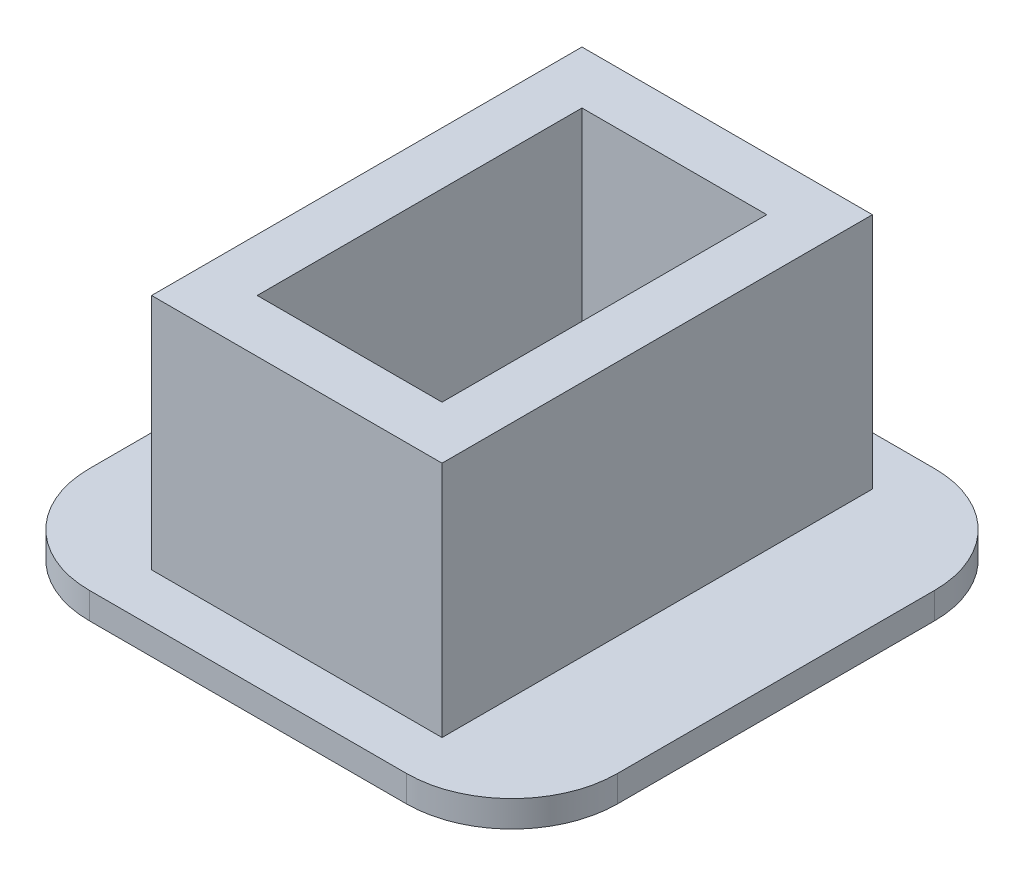
ISO-10303-21;
HEADER;
FILE_DESCRIPTION(('STEP AP214'),'2;1');
FILE_NAME('part.step','',(''),(''),'','','');
FILE_SCHEMA(('AUTOMOTIVE_DESIGN { 1 0 10303 214 1 1 1 1 }'));
ENDSEC;
DATA;
#1=APPLICATION_CONTEXT('core data for automotive mechanical design processes');
#2=APPLICATION_PROTOCOL_DEFINITION('international standard','automotive_design',2000,#1);
#3=PRODUCT_CONTEXT('',#1,'mechanical');
#4=PRODUCT('Part','Part','',(#3));
#5=PRODUCT_RELATED_PRODUCT_CATEGORY('part','',(#4));
#6=PRODUCT_DEFINITION_FORMATION('','',#4);
#7=PRODUCT_DEFINITION_CONTEXT('part definition',#1,'design');
#8=PRODUCT_DEFINITION('design','',#6,#7);
#9=PRODUCT_DEFINITION_SHAPE('','',#8);
#10=(LENGTH_UNIT() NAMED_UNIT(*) SI_UNIT(.MILLI.,.METRE.));
#11=(NAMED_UNIT(*) PLANE_ANGLE_UNIT() SI_UNIT($,.RADIAN.));
#12=(NAMED_UNIT(*) SI_UNIT($,.STERADIAN.) SOLID_ANGLE_UNIT());
#13=UNCERTAINTY_MEASURE_WITH_UNIT(LENGTH_MEASURE(1.E-05),#10,'distance_accuracy_value','');
#14=(GEOMETRIC_REPRESENTATION_CONTEXT(3) GLOBAL_UNCERTAINTY_ASSIGNED_CONTEXT((#13)) GLOBAL_UNIT_ASSIGNED_CONTEXT((#10,
#11,#12)) REPRESENTATION_CONTEXT('',''));
#15=CARTESIAN_POINT('',(0.,0.,0.));
#16=DIRECTION('',(0.,0.,1.));
#17=DIRECTION('',(1.,0.,0.));
#18=AXIS2_PLACEMENT_3D('',#15,#16,#17);
#19=CARTESIAN_POINT('',(0.,18.,0.));
#20=DIRECTION('',(0.,-1.,0.));
#21=DIRECTION('',(0.,0.,-1.));
#22=AXIS2_PLACEMENT_3D('',#19,#20,#21);
#23=PLANE('',#22);
#24=DIRECTION('',(0.,0.,-1.));
#25=VECTOR('',#24,1.);
#26=CARTESIAN_POINT('',(11.,18.,-16.3));
#27=LINE('',#26,#25);
#28=CARTESIAN_POINT('',(11.,18.,16.3));
#29=VERTEX_POINT('',#28);
#30=CARTESIAN_POINT('',(11.,18.,-16.3));
#31=VERTEX_POINT('',#30);
#32=EDGE_CURVE('E184',#29,#31,#27,.T.);
#33=ORIENTED_EDGE('',*,*,#32,.T.);
#34=DIRECTION('',(-1.,0.,0.));
#35=VECTOR('',#34,1.);
#36=CARTESIAN_POINT('',(11.,18.,-16.3));
#37=LINE('',#36,#35);
#38=CARTESIAN_POINT('',(-11.,18.,-16.3));
#39=VERTEX_POINT('',#38);
#40=EDGE_CURVE('E187',#31,#39,#37,.T.);
#41=ORIENTED_EDGE('',*,*,#40,.T.);
#42=DIRECTION('',(0.,0.,1.));
#43=VECTOR('',#42,1.);
#44=CARTESIAN_POINT('',(-11.,18.,-16.3));
#45=LINE('',#44,#43);
#46=CARTESIAN_POINT('',(-11.,18.,16.3));
#47=VERTEX_POINT('',#46);
#48=EDGE_CURVE('E190',#39,#47,#45,.T.);
#49=ORIENTED_EDGE('',*,*,#48,.T.);
#50=DIRECTION('',(1.,0.,0.));
#51=VECTOR('',#50,1.);
#52=CARTESIAN_POINT('',(11.,18.,16.3));
#53=LINE('',#52,#51);
#54=EDGE_CURVE('E192',#47,#29,#53,.T.);
#55=ORIENTED_EDGE('',*,*,#54,.T.);
#56=EDGE_LOOP('',(#33,#41,#49,#55));
#57=FACE_BOUND('',#56,.T.);
#58=DIRECTION('',(0.,0.,-1.));
#59=VECTOR('',#58,1.);
#60=CARTESIAN_POINT('',(7.,18.,-12.3));
#61=LINE('',#60,#59);
#62=CARTESIAN_POINT('',(7.00000000000001,18.,12.3));
#63=VERTEX_POINT('',#62);
#64=CARTESIAN_POINT('',(7.,18.,-12.3));
#65=VERTEX_POINT('',#64);
#66=EDGE_CURVE('E172',#63,#65,#61,.T.);
#67=ORIENTED_EDGE('',*,*,#66,.F.);
#68=DIRECTION('',(1.,0.,0.));
#69=VECTOR('',#68,1.);
#70=CARTESIAN_POINT('',(7.00000000000001,18.,12.3));
#71=LINE('',#70,#69);
#72=CARTESIAN_POINT('',(-7.,18.,12.3));
#73=VERTEX_POINT('',#72);
#74=EDGE_CURVE('E153',#73,#63,#71,.T.);
#75=ORIENTED_EDGE('',*,*,#74,.F.);
#76=DIRECTION('',(0.,0.,1.));
#77=VECTOR('',#76,1.);
#78=CARTESIAN_POINT('',(-7.,18.,-12.3));
#79=LINE('',#78,#77);
#80=CARTESIAN_POINT('',(-7.,18.,-12.3));
#81=VERTEX_POINT('',#80);
#82=EDGE_CURVE('E285',#81,#73,#79,.T.);
#83=ORIENTED_EDGE('',*,*,#82,.F.);
#84=DIRECTION('',(-1.,0.,0.));
#85=VECTOR('',#84,1.);
#86=CARTESIAN_POINT('',(7.,18.,-12.3));
#87=LINE('',#86,#85);
#88=EDGE_CURVE('E174',#65,#81,#87,.T.);
#89=ORIENTED_EDGE('',*,*,#88,.F.);
#90=EDGE_LOOP('',(#67,#75,#83,#89));
#91=FACE_BOUND('',#90,.T.);
#92=ADVANCED_FACE('F32',(#57,#91),#23,.F.);
#93=CARTESIAN_POINT('',(11.,18.,-16.3));
#94=DIRECTION('',(-1.,0.,0.));
#95=DIRECTION('',(0.,0.,1.));
#96=AXIS2_PLACEMENT_3D('',#93,#94,#95);
#97=PLANE('',#96);
#98=DIRECTION('',(0.,0.,-1.));
#99=VECTOR('',#98,1.);
#100=CARTESIAN_POINT('',(11.,0.,-16.3));
#101=LINE('',#100,#99);
#102=CARTESIAN_POINT('',(11.,0.,16.3));
#103=VERTEX_POINT('',#102);
#104=CARTESIAN_POINT('',(11.,0.,-16.3));
#105=VERTEX_POINT('',#104);
#106=EDGE_CURVE('E183',#103,#105,#101,.T.);
#107=ORIENTED_EDGE('',*,*,#106,.T.);
#108=DIRECTION('',(0.,-1.,0.));
#109=VECTOR('',#108,1.);
#110=CARTESIAN_POINT('',(11.,18.,-16.3));
#111=LINE('',#110,#109);
#112=EDGE_CURVE('E213',#31,#105,#111,.T.);
#113=ORIENTED_EDGE('',*,*,#112,.F.);
#114=ORIENTED_EDGE('',*,*,#32,.F.);
#115=DIRECTION('',(0.,-1.,0.));
#116=VECTOR('',#115,1.);
#117=CARTESIAN_POINT('',(11.,18.,16.3));
#118=LINE('',#117,#116);
#119=EDGE_CURVE('E194',#29,#103,#118,.T.);
#120=ORIENTED_EDGE('',*,*,#119,.T.);
#121=EDGE_LOOP('',(#107,#113,#114,#120));
#122=FACE_BOUND('',#121,.T.);
#123=ADVANCED_FACE('F297',(#122),#97,.F.);
#124=CARTESIAN_POINT('',(11.,18.,-16.3));
#125=DIRECTION('',(0.,0.,1.));
#126=DIRECTION('',(1.,0.,0.));
#127=AXIS2_PLACEMENT_3D('',#124,#125,#126);
#128=PLANE('',#127);
#129=DIRECTION('',(-1.,0.,0.));
#130=VECTOR('',#129,1.);
#131=CARTESIAN_POINT('',(11.,0.,-16.3));
#132=LINE('',#131,#130);
#133=CARTESIAN_POINT('',(-11.,0.,-16.3));
#134=VERTEX_POINT('',#133);
#135=EDGE_CURVE('E197',#105,#134,#132,.T.);
#136=ORIENTED_EDGE('',*,*,#135,.T.);
#137=DIRECTION('',(0.,-1.,0.));
#138=VECTOR('',#137,1.);
#139=CARTESIAN_POINT('',(-11.,18.,-16.3));
#140=LINE('',#139,#138);
#141=EDGE_CURVE('E210',#39,#134,#140,.T.);
#142=ORIENTED_EDGE('',*,*,#141,.F.);
#143=ORIENTED_EDGE('',*,*,#40,.F.);
#144=ORIENTED_EDGE('',*,*,#112,.T.);
#145=EDGE_LOOP('',(#136,#142,#143,#144));
#146=FACE_BOUND('',#145,.T.);
#147=ADVANCED_FACE('F303',(#146),#128,.F.);
#148=CARTESIAN_POINT('',(-11.,18.,-16.3));
#149=DIRECTION('',(1.,0.,0.));
#150=DIRECTION('',(0.,0.,-1.));
#151=AXIS2_PLACEMENT_3D('',#148,#149,#150);
#152=PLANE('',#151);
#153=DIRECTION('',(0.,0.,1.));
#154=VECTOR('',#153,1.);
#155=CARTESIAN_POINT('',(-11.,0.,-16.3));
#156=LINE('',#155,#154);
#157=CARTESIAN_POINT('',(-11.,0.,16.3));
#158=VERTEX_POINT('',#157);
#159=EDGE_CURVE('E200',#134,#158,#156,.T.);
#160=ORIENTED_EDGE('',*,*,#159,.T.);
#161=DIRECTION('',(0.,-1.,0.));
#162=VECTOR('',#161,1.);
#163=CARTESIAN_POINT('',(-11.,18.,16.3));
#164=LINE('',#163,#162);
#165=EDGE_CURVE('E207',#47,#158,#164,.T.);
#166=ORIENTED_EDGE('',*,*,#165,.F.);
#167=ORIENTED_EDGE('',*,*,#48,.F.);
#168=ORIENTED_EDGE('',*,*,#141,.T.);
#169=EDGE_LOOP('',(#160,#166,#167,#168));
#170=FACE_BOUND('',#169,.T.);
#171=ADVANCED_FACE('F312',(#170),#152,.F.);
#172=CARTESIAN_POINT('',(11.,18.,16.3));
#173=DIRECTION('',(0.,0.,-1.));
#174=DIRECTION('',(-1.,0.,0.));
#175=AXIS2_PLACEMENT_3D('',#172,#173,#174);
#176=PLANE('',#175);
#177=DIRECTION('',(1.,0.,0.));
#178=VECTOR('',#177,1.);
#179=CARTESIAN_POINT('',(11.,0.,16.3));
#180=LINE('',#179,#178);
#181=EDGE_CURVE('E188',#158,#103,#180,.T.);
#182=ORIENTED_EDGE('',*,*,#181,.T.);
#183=ORIENTED_EDGE('',*,*,#119,.F.);
#184=ORIENTED_EDGE('',*,*,#54,.F.);
#185=ORIENTED_EDGE('',*,*,#165,.T.);
#186=EDGE_LOOP('',(#182,#183,#184,#185));
#187=FACE_BOUND('',#186,.T.);
#188=ADVANCED_FACE('F309',(#187),#176,.F.);
#189=CARTESIAN_POINT('',(7.,18.,-12.3));
#190=DIRECTION('',(-1.,0.,0.));
#191=DIRECTION('',(0.,0.,1.));
#192=AXIS2_PLACEMENT_3D('',#189,#190,#191);
#193=PLANE('',#192);
#194=DIRECTION('',(0.,0.,-1.));
#195=VECTOR('',#194,1.);
#196=CARTESIAN_POINT('',(7.,0.,-12.3));
#197=LINE('',#196,#195);
#198=CARTESIAN_POINT('',(7.00000000000001,0.,12.3));
#199=VERTEX_POINT('',#198);
#200=CARTESIAN_POINT('',(7.,0.,-12.3));
#201=VERTEX_POINT('',#200);
#202=EDGE_CURVE('E160',#199,#201,#197,.T.);
#203=ORIENTED_EDGE('',*,*,#202,.F.);
#204=DIRECTION('',(0.,-1.,0.));
#205=VECTOR('',#204,1.);
#206=CARTESIAN_POINT('',(7.00000000000001,18.,12.3));
#207=LINE('',#206,#205);
#208=EDGE_CURVE('E146',#63,#199,#207,.T.);
#209=ORIENTED_EDGE('',*,*,#208,.F.);
#210=ORIENTED_EDGE('',*,*,#66,.T.);
#211=DIRECTION('',(0.,-1.,0.));
#212=VECTOR('',#211,1.);
#213=CARTESIAN_POINT('',(7.,18.,-12.3));
#214=LINE('',#213,#212);
#215=EDGE_CURVE('E163',#65,#201,#214,.T.);
#216=ORIENTED_EDGE('',*,*,#215,.T.);
#217=EDGE_LOOP('',(#203,#209,#210,#216));
#218=FACE_BOUND('',#217,.T.);
#219=ADVANCED_FACE('F161',(#218),#193,.T.);
#220=CARTESIAN_POINT('',(7.,18.,-12.3));
#221=DIRECTION('',(0.,0.,1.));
#222=DIRECTION('',(1.,0.,0.));
#223=AXIS2_PLACEMENT_3D('',#220,#221,#222);
#224=PLANE('',#223);
#225=DIRECTION('',(-1.,0.,0.));
#226=VECTOR('',#225,1.);
#227=CARTESIAN_POINT('',(7.,0.,-12.3));
#228=LINE('',#227,#226);
#229=CARTESIAN_POINT('',(-7.,0.,-12.3));
#230=VERTEX_POINT('',#229);
#231=EDGE_CURVE('E166',#201,#230,#228,.T.);
#232=ORIENTED_EDGE('',*,*,#231,.F.);
#233=ORIENTED_EDGE('',*,*,#215,.F.);
#234=ORIENTED_EDGE('',*,*,#88,.T.);
#235=DIRECTION('',(0.,-1.,0.));
#236=VECTOR('',#235,1.);
#237=CARTESIAN_POINT('',(-7.,18.,-12.3));
#238=LINE('',#237,#236);
#239=EDGE_CURVE('E180',#81,#230,#238,.T.);
#240=ORIENTED_EDGE('',*,*,#239,.T.);
#241=EDGE_LOOP('',(#232,#233,#234,#240));
#242=FACE_BOUND('',#241,.T.);
#243=ADVANCED_FACE('F289',(#242),#224,.T.);
#244=CARTESIAN_POINT('',(-7.,18.,-12.3));
#245=DIRECTION('',(1.,0.,0.));
#246=DIRECTION('',(0.,0.,-1.));
#247=AXIS2_PLACEMENT_3D('',#244,#245,#246);
#248=PLANE('',#247);
#249=DIRECTION('',(0.,0.,1.));
#250=VECTOR('',#249,1.);
#251=CARTESIAN_POINT('',(-7.,0.,-12.3));
#252=LINE('',#251,#250);
#253=CARTESIAN_POINT('',(-7.,0.,12.3));
#254=VERTEX_POINT('',#253);
#255=EDGE_CURVE('E171',#230,#254,#252,.T.);
#256=ORIENTED_EDGE('',*,*,#255,.F.);
#257=ORIENTED_EDGE('',*,*,#239,.F.);
#258=ORIENTED_EDGE('',*,*,#82,.T.);
#259=DIRECTION('',(0.,-1.,0.));
#260=VECTOR('',#259,1.);
#261=CARTESIAN_POINT('',(-7.,18.,12.3));
#262=LINE('',#261,#260);
#263=EDGE_CURVE('E156',#73,#254,#262,.T.);
#264=ORIENTED_EDGE('',*,*,#263,.T.);
#265=EDGE_LOOP('',(#256,#257,#258,#264));
#266=FACE_BOUND('',#265,.T.);
#267=ADVANCED_FACE('F294',(#266),#248,.T.);
#268=CARTESIAN_POINT('',(7.00000000000001,18.,12.3));
#269=DIRECTION('',(0.,0.,-1.));
#270=DIRECTION('',(-1.,0.,0.));
#271=AXIS2_PLACEMENT_3D('',#268,#269,#270);
#272=PLANE('',#271);
#273=DIRECTION('',(1.,0.,0.));
#274=VECTOR('',#273,1.);
#275=CARTESIAN_POINT('',(7.00000000000001,0.,12.3));
#276=LINE('',#275,#274);
#277=EDGE_CURVE('E150',#254,#199,#276,.T.);
#278=ORIENTED_EDGE('',*,*,#277,.F.);
#279=ORIENTED_EDGE('',*,*,#263,.F.);
#280=ORIENTED_EDGE('',*,*,#74,.T.);
#281=ORIENTED_EDGE('',*,*,#208,.T.);
#282=EDGE_LOOP('',(#278,#279,#280,#281));
#283=FACE_BOUND('',#282,.T.);
#284=ADVANCED_FACE('F148',(#283),#272,.T.);
#285=CARTESIAN_POINT('',(0.,0.,0.));
#286=DIRECTION('',(0.,1.,0.));
#287=DIRECTION('',(0.,0.,1.));
#288=AXIS2_PLACEMENT_3D('',#285,#286,#287);
#289=PLANE('',#288);
#290=ORIENTED_EDGE('',*,*,#277,.T.);
#291=ORIENTED_EDGE('',*,*,#202,.T.);
#292=ORIENTED_EDGE('',*,*,#231,.T.);
#293=ORIENTED_EDGE('',*,*,#255,.T.);
#294=EDGE_LOOP('',(#290,#291,#292,#293));
#295=FACE_BOUND('',#294,.T.);
#296=ADVANCED_FACE('F169',(#295),#289,.T.);
#297=DIRECTION('',(0.,0.,-1.));
#298=VECTOR('',#297,1.);
#299=CARTESIAN_POINT('',(-20.,0.,-20.));
#300=LINE('',#299,#298);
#301=CARTESIAN_POINT('',(-20.,0.,12.));
#302=VERTEX_POINT('',#301);
#303=CARTESIAN_POINT('',(-20.,0.,-12.));
#304=VERTEX_POINT('',#303);
#305=EDGE_CURVE('E276',#302,#304,#300,.T.);
#306=ORIENTED_EDGE('',*,*,#305,.F.);
#307=CARTESIAN_POINT('',(-12.,0.,12.));
#308=DIRECTION('',(0.,1.,0.));
#309=DIRECTION('',(0.,0.,1.));
#310=AXIS2_PLACEMENT_3D('',#307,#308,#309);
#311=CIRCLE('',#310,8.);
#312=CARTESIAN_POINT('',(-12.,0.,20.));
#313=VERTEX_POINT('',#312);
#314=EDGE_CURVE('E227',#302,#313,#311,.T.);
#315=ORIENTED_EDGE('',*,*,#314,.T.);
#316=DIRECTION('',(-1.,0.,0.));
#317=VECTOR('',#316,1.);
#318=CARTESIAN_POINT('',(-20.,0.,20.));
#319=LINE('',#318,#317);
#320=CARTESIAN_POINT('',(12.,0.,20.));
#321=VERTEX_POINT('',#320);
#322=EDGE_CURVE('E270',#321,#313,#319,.T.);
#323=ORIENTED_EDGE('',*,*,#322,.F.);
#324=CARTESIAN_POINT('',(12.,0.,12.));
#325=DIRECTION('',(0.,1.,0.));
#326=DIRECTION('',(0.,0.,1.));
#327=AXIS2_PLACEMENT_3D('',#324,#325,#326);
#328=CIRCLE('',#327,8.);
#329=CARTESIAN_POINT('',(20.,0.,12.));
#330=VERTEX_POINT('',#329);
#331=EDGE_CURVE('E225',#321,#330,#328,.T.);
#332=ORIENTED_EDGE('',*,*,#331,.T.);
#333=DIRECTION('',(0.,0.,1.));
#334=VECTOR('',#333,1.);
#335=CARTESIAN_POINT('',(20.,0.,-20.));
#336=LINE('',#335,#334);
#337=CARTESIAN_POINT('',(20.,0.,-12.));
#338=VERTEX_POINT('',#337);
#339=EDGE_CURVE('E254',#338,#330,#336,.T.);
#340=ORIENTED_EDGE('',*,*,#339,.F.);
#341=CARTESIAN_POINT('',(12.,0.,-12.));
#342=DIRECTION('',(0.,1.,0.));
#343=DIRECTION('',(0.,0.,1.));
#344=AXIS2_PLACEMENT_3D('',#341,#342,#343);
#345=CIRCLE('',#344,8.);
#346=CARTESIAN_POINT('',(12.,0.,-20.));
#347=VERTEX_POINT('',#346);
#348=EDGE_CURVE('E221',#338,#347,#345,.T.);
#349=ORIENTED_EDGE('',*,*,#348,.T.);
#350=DIRECTION('',(1.,0.,0.));
#351=VECTOR('',#350,1.);
#352=CARTESIAN_POINT('',(-20.,0.,-20.));
#353=LINE('',#352,#351);
#354=CARTESIAN_POINT('',(-12.,0.,-20.));
#355=VERTEX_POINT('',#354);
#356=EDGE_CURVE('E262',#355,#347,#353,.T.);
#357=ORIENTED_EDGE('',*,*,#356,.F.);
#358=CARTESIAN_POINT('',(-12.,0.,-12.));
#359=DIRECTION('',(0.,1.,0.));
#360=DIRECTION('',(0.,0.,1.));
#361=AXIS2_PLACEMENT_3D('',#358,#359,#360);
#362=CIRCLE('',#361,8.);
#363=EDGE_CURVE('E223',#355,#304,#362,.T.);
#364=ORIENTED_EDGE('',*,*,#363,.T.);
#365=EDGE_LOOP('',(#306,#315,#323,#332,#340,#349,#357,#364));
#366=FACE_BOUND('',#365,.T.);
#367=ORIENTED_EDGE('',*,*,#106,.F.);
#368=ORIENTED_EDGE('',*,*,#181,.F.);
#369=ORIENTED_EDGE('',*,*,#159,.F.);
#370=ORIENTED_EDGE('',*,*,#135,.F.);
#371=EDGE_LOOP('',(#367,#368,#369,#370));
#372=FACE_BOUND('',#371,.T.);
#373=ADVANCED_FACE('F274',(#366,#372),#289,.T.);
#374=CARTESIAN_POINT('',(20.,-2.,-20.));
#375=DIRECTION('',(-1.,0.,0.));
#376=DIRECTION('',(0.,0.,1.));
#377=AXIS2_PLACEMENT_3D('',#374,#375,#376);
#378=PLANE('',#377);
#379=ORIENTED_EDGE('',*,*,#339,.T.);
#380=DIRECTION('',(0.,1.,0.));
#381=VECTOR('',#380,1.);
#382=CARTESIAN_POINT('',(20.,-2.,12.));
#383=LINE('',#382,#381);
#384=CARTESIAN_POINT('',(20.,-2.,12.));
#385=VERTEX_POINT('',#384);
#386=EDGE_CURVE('E244',#330,#385,#383,.F.);
#387=ORIENTED_EDGE('',*,*,#386,.T.);
#388=DIRECTION('',(0.,0.,1.));
#389=VECTOR('',#388,1.);
#390=CARTESIAN_POINT('',(20.,-2.,-20.));
#391=LINE('',#390,#389);
#392=CARTESIAN_POINT('',(20.,-2.,-12.));
#393=VERTEX_POINT('',#392);
#394=EDGE_CURVE('E251',#393,#385,#391,.T.);
#395=ORIENTED_EDGE('',*,*,#394,.F.);
#396=DIRECTION('',(0.,1.,0.));
#397=VECTOR('',#396,1.);
#398=CARTESIAN_POINT('',(20.,-2.,-12.));
#399=LINE('',#398,#397);
#400=EDGE_CURVE('E241',#393,#338,#399,.T.);
#401=ORIENTED_EDGE('',*,*,#400,.T.);
#402=EDGE_LOOP('',(#379,#387,#395,#401));
#403=FACE_BOUND('',#402,.T.);
#404=ADVANCED_FACE('F250',(#403),#378,.F.);
#405=CARTESIAN_POINT('',(-20.,-2.,20.));
#406=DIRECTION('',(0.,0.,-1.));
#407=DIRECTION('',(-1.,0.,0.));
#408=AXIS2_PLACEMENT_3D('',#405,#406,#407);
#409=PLANE('',#408);
#410=ORIENTED_EDGE('',*,*,#322,.T.);
#411=DIRECTION('',(0.,1.,0.));
#412=VECTOR('',#411,1.);
#413=CARTESIAN_POINT('',(-12.,-2.,20.));
#414=LINE('',#413,#412);
#415=CARTESIAN_POINT('',(-12.,-2.,20.));
#416=VERTEX_POINT('',#415);
#417=EDGE_CURVE('E232',#313,#416,#414,.F.);
#418=ORIENTED_EDGE('',*,*,#417,.T.);
#419=DIRECTION('',(-1.,0.,0.));
#420=VECTOR('',#419,1.);
#421=CARTESIAN_POINT('',(-20.,-2.,20.));
#422=LINE('',#421,#420);
#423=CARTESIAN_POINT('',(12.,-2.,20.));
#424=VERTEX_POINT('',#423);
#425=EDGE_CURVE('E261',#424,#416,#422,.T.);
#426=ORIENTED_EDGE('',*,*,#425,.F.);
#427=DIRECTION('',(0.,1.,0.));
#428=VECTOR('',#427,1.);
#429=CARTESIAN_POINT('',(12.,-2.,20.));
#430=LINE('',#429,#428);
#431=EDGE_CURVE('E229',#424,#321,#430,.T.);
#432=ORIENTED_EDGE('',*,*,#431,.T.);
#433=EDGE_LOOP('',(#410,#418,#426,#432));
#434=FACE_BOUND('',#433,.T.);
#435=ADVANCED_FACE('F269',(#434),#409,.F.);
#436=CARTESIAN_POINT('',(-20.,-2.,-20.));
#437=DIRECTION('',(1.,0.,0.));
#438=DIRECTION('',(0.,0.,-1.));
#439=AXIS2_PLACEMENT_3D('',#436,#437,#438);
#440=PLANE('',#439);
#441=DIRECTION('',(0.,0.,-1.));
#442=VECTOR('',#441,1.);
#443=CARTESIAN_POINT('',(-20.,-2.,-20.));
#444=LINE('',#443,#442);
#445=CARTESIAN_POINT('',(-20.,-2.,12.));
#446=VERTEX_POINT('',#445);
#447=CARTESIAN_POINT('',(-20.,-2.,-12.));
#448=VERTEX_POINT('',#447);
#449=EDGE_CURVE('E340',#446,#448,#444,.T.);
#450=ORIENTED_EDGE('',*,*,#449,.F.);
#451=DIRECTION('',(0.,1.,0.));
#452=VECTOR('',#451,1.);
#453=CARTESIAN_POINT('',(-20.,-2.,12.));
#454=LINE('',#453,#452);
#455=EDGE_CURVE('E218',#446,#302,#454,.T.);
#456=ORIENTED_EDGE('',*,*,#455,.T.);
#457=ORIENTED_EDGE('',*,*,#305,.T.);
#458=DIRECTION('',(0.,1.,0.));
#459=VECTOR('',#458,1.);
#460=CARTESIAN_POINT('',(-20.,-2.,-12.));
#461=LINE('',#460,#459);
#462=EDGE_CURVE('E216',#304,#448,#461,.F.);
#463=ORIENTED_EDGE('',*,*,#462,.T.);
#464=EDGE_LOOP('',(#450,#456,#457,#463));
#465=FACE_BOUND('',#464,.T.);
#466=ADVANCED_FACE('F338',(#465),#440,.F.);
#467=CARTESIAN_POINT('',(-20.,-2.,-20.));
#468=DIRECTION('',(0.,0.,1.));
#469=DIRECTION('',(1.,0.,0.));
#470=AXIS2_PLACEMENT_3D('',#467,#468,#469);
#471=PLANE('',#470);
#472=DIRECTION('',(1.,0.,0.));
#473=VECTOR('',#472,1.);
#474=CARTESIAN_POINT('',(-20.,-2.,-20.));
#475=LINE('',#474,#473);
#476=CARTESIAN_POINT('',(-12.,-2.,-20.));
#477=VERTEX_POINT('',#476);
#478=CARTESIAN_POINT('',(12.,-2.,-20.));
#479=VERTEX_POINT('',#478);
#480=EDGE_CURVE('E167',#477,#479,#475,.T.);
#481=ORIENTED_EDGE('',*,*,#480,.F.);
#482=DIRECTION('',(0.,1.,0.));
#483=VECTOR('',#482,1.);
#484=CARTESIAN_POINT('',(-12.,-2.,-20.));
#485=LINE('',#484,#483);
#486=EDGE_CURVE('E11',#477,#355,#485,.T.);
#487=ORIENTED_EDGE('',*,*,#486,.T.);
#488=ORIENTED_EDGE('',*,*,#356,.T.);
#489=DIRECTION('',(0.,1.,0.));
#490=VECTOR('',#489,1.);
#491=CARTESIAN_POINT('',(12.,-2.,-20.));
#492=LINE('',#491,#490);
#493=EDGE_CURVE('E40',#347,#479,#492,.F.);
#494=ORIENTED_EDGE('',*,*,#493,.T.);
#495=EDGE_LOOP('',(#481,#487,#488,#494));
#496=FACE_BOUND('',#495,.T.);
#497=ADVANCED_FACE('F335',(#496),#471,.F.);
#498=CARTESIAN_POINT('',(0.,-2.,0.));
#499=DIRECTION('',(0.,1.,0.));
#500=DIRECTION('',(0.,0.,1.));
#501=AXIS2_PLACEMENT_3D('',#498,#499,#500);
#502=PLANE('',#501);
#503=ORIENTED_EDGE('',*,*,#425,.T.);
#504=CARTESIAN_POINT('',(-12.,-2.,12.));
#505=DIRECTION('',(0.,1.,0.));
#506=DIRECTION('',(0.,0.,1.));
#507=AXIS2_PLACEMENT_3D('',#504,#505,#506);
#508=CIRCLE('',#507,8.);
#509=EDGE_CURVE('E239',#416,#446,#508,.F.);
#510=ORIENTED_EDGE('',*,*,#509,.T.);
#511=ORIENTED_EDGE('',*,*,#449,.T.);
#512=CARTESIAN_POINT('',(-12.,-2.,-12.));
#513=DIRECTION('',(0.,1.,0.));
#514=DIRECTION('',(0.,0.,1.));
#515=AXIS2_PLACEMENT_3D('',#512,#513,#514);
#516=CIRCLE('',#515,8.);
#517=EDGE_CURVE('E53',#448,#477,#516,.F.);
#518=ORIENTED_EDGE('',*,*,#517,.T.);
#519=ORIENTED_EDGE('',*,*,#480,.T.);
#520=CARTESIAN_POINT('',(12.,-2.,-12.));
#521=DIRECTION('',(0.,1.,0.));
#522=DIRECTION('',(0.,0.,1.));
#523=AXIS2_PLACEMENT_3D('',#520,#521,#522);
#524=CIRCLE('',#523,8.);
#525=EDGE_CURVE('E234',#479,#393,#524,.F.);
#526=ORIENTED_EDGE('',*,*,#525,.T.);
#527=ORIENTED_EDGE('',*,*,#394,.T.);
#528=CARTESIAN_POINT('',(12.,-2.,12.));
#529=DIRECTION('',(0.,1.,0.));
#530=DIRECTION('',(0.,0.,1.));
#531=AXIS2_PLACEMENT_3D('',#528,#529,#530);
#532=CIRCLE('',#531,8.);
#533=EDGE_CURVE('E237',#385,#424,#532,.F.);
#534=ORIENTED_EDGE('',*,*,#533,.T.);
#535=EDGE_LOOP('',(#503,#510,#511,#518,#519,#526,#527,#534));
#536=FACE_BOUND('',#535,.T.);
#537=ADVANCED_FACE('F258',(#536),#502,.F.);
#538=CARTESIAN_POINT('',(-12.,-2.,12.));
#539=DIRECTION('',(0.,1.,0.));
#540=DIRECTION('',(0.,0.,1.));
#541=AXIS2_PLACEMENT_3D('',#538,#539,#540);
#542=CYLINDRICAL_SURFACE('',#541,8.);
#543=ORIENTED_EDGE('',*,*,#509,.F.);
#544=ORIENTED_EDGE('',*,*,#417,.F.);
#545=ORIENTED_EDGE('',*,*,#314,.F.);
#546=ORIENTED_EDGE('',*,*,#455,.F.);
#547=EDGE_LOOP('',(#543,#544,#545,#546));
#548=FACE_BOUND('',#547,.T.);
#549=ADVANCED_FACE('F320',(#548),#542,.T.);
#550=CARTESIAN_POINT('',(12.,-2.,12.));
#551=DIRECTION('',(0.,1.,0.));
#552=DIRECTION('',(0.,0.,1.));
#553=AXIS2_PLACEMENT_3D('',#550,#551,#552);
#554=CYLINDRICAL_SURFACE('',#553,8.);
#555=ORIENTED_EDGE('',*,*,#533,.F.);
#556=ORIENTED_EDGE('',*,*,#386,.F.);
#557=ORIENTED_EDGE('',*,*,#331,.F.);
#558=ORIENTED_EDGE('',*,*,#431,.F.);
#559=EDGE_LOOP('',(#555,#556,#557,#558));
#560=FACE_BOUND('',#559,.T.);
#561=ADVANCED_FACE('F265',(#560),#554,.T.);
#562=CARTESIAN_POINT('',(-12.,-2.,-12.));
#563=DIRECTION('',(0.,1.,0.));
#564=DIRECTION('',(0.,0.,1.));
#565=AXIS2_PLACEMENT_3D('',#562,#563,#564);
#566=CYLINDRICAL_SURFACE('',#565,8.);
#567=ORIENTED_EDGE('',*,*,#517,.F.);
#568=ORIENTED_EDGE('',*,*,#462,.F.);
#569=ORIENTED_EDGE('',*,*,#363,.F.);
#570=ORIENTED_EDGE('',*,*,#486,.F.);
#571=EDGE_LOOP('',(#567,#568,#569,#570));
#572=FACE_BOUND('',#571,.T.);
#573=ADVANCED_FACE('F325',(#572),#566,.T.);
#574=CARTESIAN_POINT('',(12.,-2.,-12.));
#575=DIRECTION('',(0.,1.,0.));
#576=DIRECTION('',(0.,0.,1.));
#577=AXIS2_PLACEMENT_3D('',#574,#575,#576);
#578=CYLINDRICAL_SURFACE('',#577,8.);
#579=ORIENTED_EDGE('',*,*,#525,.F.);
#580=ORIENTED_EDGE('',*,*,#493,.F.);
#581=ORIENTED_EDGE('',*,*,#348,.F.);
#582=ORIENTED_EDGE('',*,*,#400,.F.);
#583=EDGE_LOOP('',(#579,#580,#581,#582));
#584=FACE_BOUND('',#583,.T.);
#585=ADVANCED_FACE('F34',(#584),#578,.T.);
#586=CLOSED_SHELL('',(#92,#123,#147,#171,#188,#219,#243,#267,#284,#296,#373,#404,#435,#466,#497,
#537,#549,#561,#573,#585));
#587=MANIFOLD_SOLID_BREP('B2',#586);
#588=ADVANCED_BREP_SHAPE_REPRESENTATION('',(#18,#587),#14);
#589=SHAPE_DEFINITION_REPRESENTATION(#9,#588);
ENDSEC;
END-ISO-10303-21;
